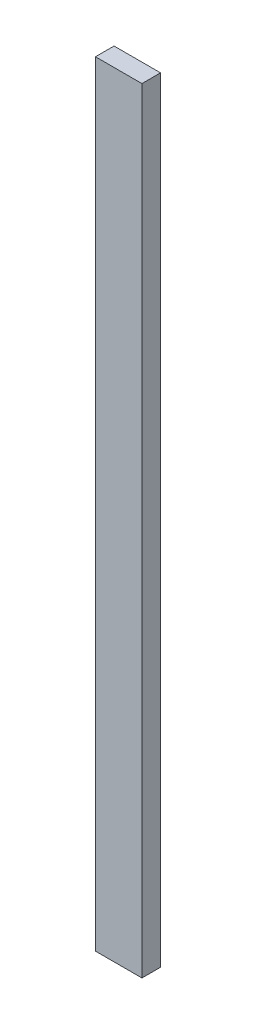
ISO-10303-21;
HEADER;
FILE_DESCRIPTION(('STEP AP214'),'2;1');
FILE_NAME('part.step','',(''),(''),'','','');
FILE_SCHEMA(('AUTOMOTIVE_DESIGN { 1 0 10303 214 1 1 1 1 }'));
ENDSEC;
DATA;
#1=APPLICATION_CONTEXT('core data for automotive mechanical design processes');
#2=APPLICATION_PROTOCOL_DEFINITION('international standard','automotive_design',2000,#1);
#3=PRODUCT_CONTEXT('',#1,'mechanical');
#4=PRODUCT('Part','Part','',(#3));
#5=PRODUCT_RELATED_PRODUCT_CATEGORY('part','',(#4));
#6=PRODUCT_DEFINITION_FORMATION('','',#4);
#7=PRODUCT_DEFINITION_CONTEXT('part definition',#1,'design');
#8=PRODUCT_DEFINITION('design','',#6,#7);
#9=PRODUCT_DEFINITION_SHAPE('','',#8);
#10=(LENGTH_UNIT() NAMED_UNIT(*) SI_UNIT(.MILLI.,.METRE.));
#11=(NAMED_UNIT(*) PLANE_ANGLE_UNIT() SI_UNIT($,.RADIAN.));
#12=(NAMED_UNIT(*) SI_UNIT($,.STERADIAN.) SOLID_ANGLE_UNIT());
#13=UNCERTAINTY_MEASURE_WITH_UNIT(LENGTH_MEASURE(1.E-05),#10,'distance_accuracy_value','');
#14=(GEOMETRIC_REPRESENTATION_CONTEXT(3) GLOBAL_UNCERTAINTY_ASSIGNED_CONTEXT((#13)) GLOBAL_UNIT_ASSIGNED_CONTEXT((#10,
#11,#12)) REPRESENTATION_CONTEXT('',''));
#15=CARTESIAN_POINT('',(0.,0.,0.));
#16=DIRECTION('',(0.,0.,1.));
#17=DIRECTION('',(1.,0.,0.));
#18=AXIS2_PLACEMENT_3D('',#15,#16,#17);
#19=CARTESIAN_POINT('',(-7.50000000000002,125.,6.));
#20=DIRECTION('',(1.,0.,0.));
#21=DIRECTION('',(0.,1.,0.));
#22=AXIS2_PLACEMENT_3D('',#19,#20,#21);
#23=PLANE('',#22);
#24=DIRECTION('',(0.,-1.,0.));
#25=VECTOR('',#24,1.);
#26=CARTESIAN_POINT('',(-7.50000000000002,125.,0.));
#27=LINE('',#26,#25);
#28=CARTESIAN_POINT('',(-7.50000000000002,125.,0.));
#29=VERTEX_POINT('',#28);
#30=CARTESIAN_POINT('',(-7.49999999999998,-125.,0.));
#31=VERTEX_POINT('',#30);
#32=EDGE_CURVE('E96',#29,#31,#27,.T.);
#33=ORIENTED_EDGE('',*,*,#32,.T.);
#34=DIRECTION('',(0.,0.,-1.));
#35=VECTOR('',#34,1.);
#36=CARTESIAN_POINT('',(-7.49999999999998,-125.,6.));
#37=LINE('',#36,#35);
#38=CARTESIAN_POINT('',(-7.49999999999998,-125.,6.));
#39=VERTEX_POINT('',#38);
#40=EDGE_CURVE('E11',#39,#31,#37,.T.);
#41=ORIENTED_EDGE('',*,*,#40,.F.);
#42=DIRECTION('',(0.,-1.,0.));
#43=VECTOR('',#42,1.);
#44=CARTESIAN_POINT('',(-7.50000000000002,125.,6.));
#45=LINE('',#44,#43);
#46=CARTESIAN_POINT('',(-7.50000000000002,125.,6.));
#47=VERTEX_POINT('',#46);
#48=EDGE_CURVE('E84',#47,#39,#45,.T.);
#49=ORIENTED_EDGE('',*,*,#48,.F.);
#50=DIRECTION('',(0.,0.,-1.));
#51=VECTOR('',#50,1.);
#52=CARTESIAN_POINT('',(-7.50000000000002,125.,6.));
#53=LINE('',#52,#51);
#54=EDGE_CURVE('E92',#47,#29,#53,.T.);
#55=ORIENTED_EDGE('',*,*,#54,.T.);
#56=EDGE_LOOP('',(#33,#41,#49,#55));
#57=FACE_BOUND('',#56,.T.);
#58=ADVANCED_FACE('F33',(#57),#23,.F.);
#59=CARTESIAN_POINT('',(-7.49999999999998,-125.,6.));
#60=DIRECTION('',(0.,1.,0.));
#61=DIRECTION('',(0.,0.,1.));
#62=AXIS2_PLACEMENT_3D('',#59,#60,#61);
#63=PLANE('',#62);
#64=DIRECTION('',(1.,0.,0.));
#65=VECTOR('',#64,1.);
#66=CARTESIAN_POINT('',(-7.49999999999998,-125.,0.));
#67=LINE('',#66,#65);
#68=CARTESIAN_POINT('',(7.50000000000001,-125.,0.));
#69=VERTEX_POINT('',#68);
#70=EDGE_CURVE('E88',#31,#69,#67,.T.);
#71=ORIENTED_EDGE('',*,*,#70,.T.);
#72=DIRECTION('',(0.,0.,-1.));
#73=VECTOR('',#72,1.);
#74=CARTESIAN_POINT('',(7.50000000000001,-125.,6.));
#75=LINE('',#74,#73);
#76=CARTESIAN_POINT('',(7.50000000000001,-125.,6.));
#77=VERTEX_POINT('',#76);
#78=EDGE_CURVE('E41',#77,#69,#75,.T.);
#79=ORIENTED_EDGE('',*,*,#78,.F.);
#80=DIRECTION('',(1.,0.,0.));
#81=VECTOR('',#80,1.);
#82=CARTESIAN_POINT('',(-7.49999999999998,-125.,6.));
#83=LINE('',#82,#81);
#84=EDGE_CURVE('E79',#39,#77,#83,.T.);
#85=ORIENTED_EDGE('',*,*,#84,.F.);
#86=ORIENTED_EDGE('',*,*,#40,.T.);
#87=EDGE_LOOP('',(#71,#79,#85,#86));
#88=FACE_BOUND('',#87,.T.);
#89=ADVANCED_FACE('F87',(#88),#63,.F.);
#90=CARTESIAN_POINT('',(7.49999999999998,125.,6.));
#91=DIRECTION('',(-1.,0.,0.));
#92=DIRECTION('',(0.,-1.,0.));
#93=AXIS2_PLACEMENT_3D('',#90,#91,#92);
#94=PLANE('',#93);
#95=DIRECTION('',(0.,1.,0.));
#96=VECTOR('',#95,1.);
#97=CARTESIAN_POINT('',(7.49999999999998,125.,0.));
#98=LINE('',#97,#96);
#99=CARTESIAN_POINT('',(7.49999999999998,125.,0.));
#100=VERTEX_POINT('',#99);
#101=EDGE_CURVE('E66',#69,#100,#98,.T.);
#102=ORIENTED_EDGE('',*,*,#101,.T.);
#103=DIRECTION('',(0.,0.,-1.));
#104=VECTOR('',#103,1.);
#105=CARTESIAN_POINT('',(7.49999999999998,125.,6.));
#106=LINE('',#105,#104);
#107=CARTESIAN_POINT('',(7.49999999999998,125.,6.));
#108=VERTEX_POINT('',#107);
#109=EDGE_CURVE('E89',#108,#100,#106,.T.);
#110=ORIENTED_EDGE('',*,*,#109,.F.);
#111=DIRECTION('',(0.,1.,0.));
#112=VECTOR('',#111,1.);
#113=CARTESIAN_POINT('',(7.49999999999998,125.,6.));
#114=LINE('',#113,#112);
#115=EDGE_CURVE('E82',#77,#108,#114,.T.);
#116=ORIENTED_EDGE('',*,*,#115,.F.);
#117=ORIENTED_EDGE('',*,*,#78,.T.);
#118=EDGE_LOOP('',(#102,#110,#116,#117));
#119=FACE_BOUND('',#118,.T.);
#120=ADVANCED_FACE('F90',(#119),#94,.F.);
#121=CARTESIAN_POINT('',(-7.50000000000002,125.,6.));
#122=DIRECTION('',(0.,-1.,0.));
#123=DIRECTION('',(0.,0.,-1.));
#124=AXIS2_PLACEMENT_3D('',#121,#122,#123);
#125=PLANE('',#124);
#126=DIRECTION('',(-1.,0.,0.));
#127=VECTOR('',#126,1.);
#128=CARTESIAN_POINT('',(-7.50000000000002,125.,0.));
#129=LINE('',#128,#127);
#130=EDGE_CURVE('E72',#100,#29,#129,.T.);
#131=ORIENTED_EDGE('',*,*,#130,.T.);
#132=ORIENTED_EDGE('',*,*,#54,.F.);
#133=DIRECTION('',(-1.,0.,0.));
#134=VECTOR('',#133,1.);
#135=CARTESIAN_POINT('',(-7.50000000000002,125.,6.));
#136=LINE('',#135,#134);
#137=EDGE_CURVE('E49',#108,#47,#136,.T.);
#138=ORIENTED_EDGE('',*,*,#137,.F.);
#139=ORIENTED_EDGE('',*,*,#109,.T.);
#140=EDGE_LOOP('',(#131,#132,#138,#139));
#141=FACE_BOUND('',#140,.T.);
#142=ADVANCED_FACE('F103',(#141),#125,.F.);
#143=CARTESIAN_POINT('',(0.,0.,6.));
#144=DIRECTION('',(0.,0.,1.));
#145=DIRECTION('',(1.,0.,0.));
#146=AXIS2_PLACEMENT_3D('',#143,#144,#145);
#147=PLANE('',#146);
#148=ORIENTED_EDGE('',*,*,#48,.T.);
#149=ORIENTED_EDGE('',*,*,#84,.T.);
#150=ORIENTED_EDGE('',*,*,#115,.T.);
#151=ORIENTED_EDGE('',*,*,#137,.T.);
#152=EDGE_LOOP('',(#148,#149,#150,#151));
#153=FACE_BOUND('',#152,.T.);
#154=ADVANCED_FACE('F80',(#153),#147,.T.);
#155=CARTESIAN_POINT('',(0.,0.,0.));
#156=DIRECTION('',(0.,0.,1.));
#157=DIRECTION('',(1.,0.,0.));
#158=AXIS2_PLACEMENT_3D('',#155,#156,#157);
#159=PLANE('',#158);
#160=ORIENTED_EDGE('',*,*,#32,.F.);
#161=ORIENTED_EDGE('',*,*,#130,.F.);
#162=ORIENTED_EDGE('',*,*,#101,.F.);
#163=ORIENTED_EDGE('',*,*,#70,.F.);
#164=EDGE_LOOP('',(#160,#161,#162,#163));
#165=FACE_BOUND('',#164,.T.);
#166=ADVANCED_FACE('F106',(#165),#159,.F.);
#167=CLOSED_SHELL('',(#58,#89,#120,#142,#154,#166));
#168=MANIFOLD_SOLID_BREP('B2',#167);
#169=ADVANCED_BREP_SHAPE_REPRESENTATION('',(#18,#168),#14);
#170=SHAPE_DEFINITION_REPRESENTATION(#9,#169);
ENDSEC;
END-ISO-10303-21;
